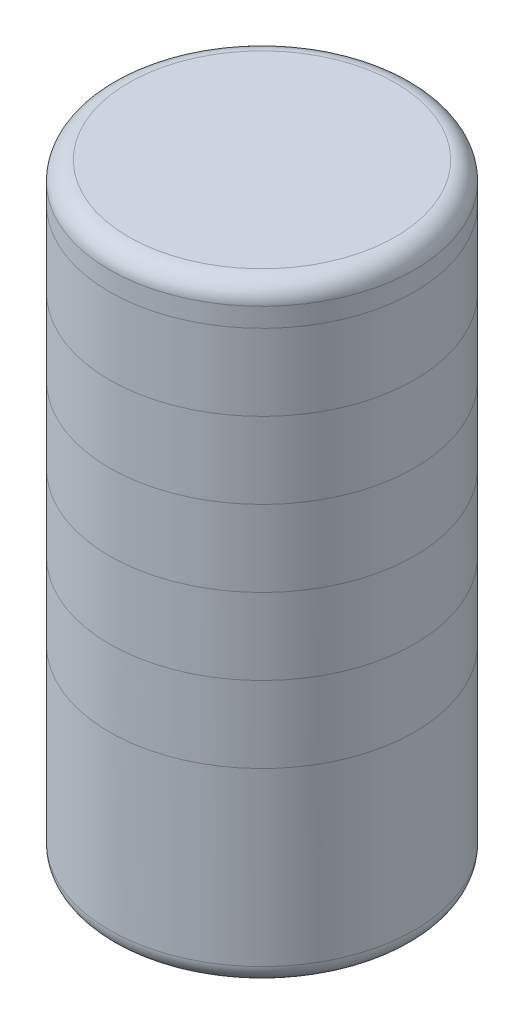
ISO-10303-21;
HEADER;
FILE_DESCRIPTION(('STEP AP214'),'2;1');
FILE_NAME('part.step','',(''),(''),'','','');
FILE_SCHEMA(('AUTOMOTIVE_DESIGN { 1 0 10303 214 1 1 1 1 }'));
ENDSEC;
DATA;
#1=APPLICATION_CONTEXT('core data for automotive mechanical design processes');
#2=APPLICATION_PROTOCOL_DEFINITION('international standard','automotive_design',2000,#1);
#3=PRODUCT_CONTEXT('',#1,'mechanical');
#4=PRODUCT('Part','Part','',(#3));
#5=PRODUCT_RELATED_PRODUCT_CATEGORY('part','',(#4));
#6=PRODUCT_DEFINITION_FORMATION('','',#4);
#7=PRODUCT_DEFINITION_CONTEXT('part definition',#1,'design');
#8=PRODUCT_DEFINITION('design','',#6,#7);
#9=PRODUCT_DEFINITION_SHAPE('','',#8);
#10=(LENGTH_UNIT() NAMED_UNIT(*) SI_UNIT(.MILLI.,.METRE.));
#11=(NAMED_UNIT(*) PLANE_ANGLE_UNIT() SI_UNIT($,.RADIAN.));
#12=(NAMED_UNIT(*) SI_UNIT($,.STERADIAN.) SOLID_ANGLE_UNIT());
#13=UNCERTAINTY_MEASURE_WITH_UNIT(LENGTH_MEASURE(1.E-05),#10,'distance_accuracy_value','');
#14=(GEOMETRIC_REPRESENTATION_CONTEXT(3) GLOBAL_UNCERTAINTY_ASSIGNED_CONTEXT((#13)) GLOBAL_UNIT_ASSIGNED_CONTEXT((#10,
#11,#12)) REPRESENTATION_CONTEXT('',''));
#15=CARTESIAN_POINT('',(0.,0.,0.));
#16=DIRECTION('',(0.,0.,1.));
#17=DIRECTION('',(1.,0.,0.));
#18=AXIS2_PLACEMENT_3D('',#15,#16,#17);
#19=CARTESIAN_POINT('',(0.,101.6,0.));
#20=DIRECTION('',(0.,-1.,0.));
#21=DIRECTION('',(0.,0.,-1.));
#22=AXIS2_PLACEMENT_3D('',#19,#20,#21);
#23=CYLINDRICAL_SURFACE('',#22,25.4);
#24=CARTESIAN_POINT('',(0.,31.75,0.));
#25=DIRECTION('',(0.,1.,0.));
#26=DIRECTION('',(-1.,0.,0.));
#27=AXIS2_PLACEMENT_3D('',#24,#25,#26);
#28=CIRCLE('',#27,25.4);
#29=CARTESIAN_POINT('',(-25.4,31.75,0.));
#30=VERTEX_POINT('',#29);
#31=EDGE_CURVE('E70',#30,#30,#28,.T.);
#32=ORIENTED_EDGE('',*,*,#31,.T.);
#33=EDGE_LOOP('',(#32));
#34=FACE_BOUND('',#33,.T.);
#35=CARTESIAN_POINT('',(0.,44.45,0.));
#36=DIRECTION('',(0.,1.,0.));
#37=DIRECTION('',(0.,0.,1.));
#38=AXIS2_PLACEMENT_3D('',#35,#36,#37);
#39=CIRCLE('',#38,25.4);
#40=CARTESIAN_POINT('',(0.,44.45,25.4));
#41=VERTEX_POINT('',#40);
#42=EDGE_CURVE('E54',#41,#41,#39,.T.);
#43=ORIENTED_EDGE('',*,*,#42,.F.);
#44=EDGE_LOOP('',(#43));
#45=FACE_BOUND('',#44,.T.);
#46=ADVANCED_FACE('F34',(#34,#45),#23,.T.);
#47=ORIENTED_EDGE('',*,*,#42,.T.);
#48=EDGE_LOOP('',(#47));
#49=FACE_BOUND('',#48,.T.);
#50=CARTESIAN_POINT('',(0.,57.15,0.));
#51=DIRECTION('',(0.,1.,0.));
#52=DIRECTION('',(0.,0.,1.));
#53=AXIS2_PLACEMENT_3D('',#50,#51,#52);
#54=CIRCLE('',#53,25.4);
#55=CARTESIAN_POINT('',(0.,57.15,25.4));
#56=VERTEX_POINT('',#55);
#57=EDGE_CURVE('E58',#56,#56,#54,.T.);
#58=ORIENTED_EDGE('',*,*,#57,.F.);
#59=EDGE_LOOP('',(#58));
#60=FACE_BOUND('',#59,.T.);
#61=ADVANCED_FACE('F97',(#49,#60),#23,.T.);
#62=ORIENTED_EDGE('',*,*,#57,.T.);
#63=EDGE_LOOP('',(#62));
#64=FACE_BOUND('',#63,.T.);
#65=CARTESIAN_POINT('',(0.,69.85,0.));
#66=DIRECTION('',(0.,1.,0.));
#67=DIRECTION('',(0.,0.,1.));
#68=AXIS2_PLACEMENT_3D('',#65,#66,#67);
#69=CIRCLE('',#68,25.4);
#70=CARTESIAN_POINT('',(0.,69.85,25.4));
#71=VERTEX_POINT('',#70);
#72=EDGE_CURVE('E62',#71,#71,#69,.T.);
#73=ORIENTED_EDGE('',*,*,#72,.F.);
#74=EDGE_LOOP('',(#73));
#75=FACE_BOUND('',#74,.T.);
#76=ADVANCED_FACE('F102',(#64,#75),#23,.T.);
#77=ORIENTED_EDGE('',*,*,#72,.T.);
#78=EDGE_LOOP('',(#77));
#79=FACE_BOUND('',#78,.T.);
#80=CARTESIAN_POINT('',(0.,82.55,0.));
#81=DIRECTION('',(0.,1.,0.));
#82=DIRECTION('',(0.,0.,1.));
#83=AXIS2_PLACEMENT_3D('',#80,#81,#82);
#84=CIRCLE('',#83,25.4);
#85=CARTESIAN_POINT('',(0.,82.55,25.4));
#86=VERTEX_POINT('',#85);
#87=EDGE_CURVE('E66',#86,#86,#84,.T.);
#88=ORIENTED_EDGE('',*,*,#87,.F.);
#89=EDGE_LOOP('',(#88));
#90=FACE_BOUND('',#89,.T.);
#91=ADVANCED_FACE('F94',(#79,#90),#23,.T.);
#92=CARTESIAN_POINT('',(0.,3.175,0.));
#93=DIRECTION('',(0.,1.,0.));
#94=DIRECTION('',(0.,0.,1.));
#95=AXIS2_PLACEMENT_3D('',#92,#93,#94);
#96=CIRCLE('',#95,25.4);
#97=CARTESIAN_POINT('',(0.,3.175,25.4));
#98=VERTEX_POINT('',#97);
#99=EDGE_CURVE('E41',#98,#98,#96,.T.);
#100=ORIENTED_EDGE('',*,*,#99,.T.);
#101=EDGE_LOOP('',(#100));
#102=FACE_BOUND('',#101,.T.);
#103=ORIENTED_EDGE('',*,*,#31,.F.);
#104=EDGE_LOOP('',(#103));
#105=FACE_BOUND('',#104,.T.);
#106=ADVANCED_FACE('F85',(#102,#105),#23,.T.);
#107=CARTESIAN_POINT('',(0.,98.425,0.));
#108=DIRECTION('',(0.,1.,0.));
#109=DIRECTION('',(0.,0.,1.));
#110=AXIS2_PLACEMENT_3D('',#107,#108,#109);
#111=CIRCLE('',#110,25.4);
#112=CARTESIAN_POINT('',(0.,98.425,25.4));
#113=VERTEX_POINT('',#112);
#114=EDGE_CURVE('E45',#113,#113,#111,.F.);
#115=ORIENTED_EDGE('',*,*,#114,.T.);
#116=EDGE_LOOP('',(#115));
#117=FACE_BOUND('',#116,.T.);
#118=CARTESIAN_POINT('',(0.,95.25,0.));
#119=DIRECTION('',(0.,-1.,0.));
#120=DIRECTION('',(0.,0.,-1.));
#121=AXIS2_PLACEMENT_3D('',#118,#119,#120);
#122=CIRCLE('',#121,25.4);
#123=CARTESIAN_POINT('',(0.,95.25,-25.4));
#124=VERTEX_POINT('',#123);
#125=EDGE_CURVE('E74',#124,#124,#122,.T.);
#126=ORIENTED_EDGE('',*,*,#125,.F.);
#127=EDGE_LOOP('',(#126));
#128=FACE_BOUND('',#127,.T.);
#129=ADVANCED_FACE('F83',(#117,#128),#23,.T.);
#130=ORIENTED_EDGE('',*,*,#87,.T.);
#131=EDGE_LOOP('',(#130));
#132=FACE_BOUND('',#131,.T.);
#133=ORIENTED_EDGE('',*,*,#125,.T.);
#134=EDGE_LOOP('',(#133));
#135=FACE_BOUND('',#134,.T.);
#136=ADVANCED_FACE('F81',(#132,#135),#23,.T.);
#137=CARTESIAN_POINT('',(0.,101.6,0.));
#138=DIRECTION('',(0.,1.,0.));
#139=DIRECTION('',(0.,0.,1.));
#140=AXIS2_PLACEMENT_3D('',#137,#138,#139);
#141=PLANE('',#140);
#142=CARTESIAN_POINT('',(0.,101.6,0.));
#143=DIRECTION('',(0.,1.,0.));
#144=DIRECTION('',(0.,0.,1.));
#145=AXIS2_PLACEMENT_3D('',#142,#143,#144);
#146=CIRCLE('',#145,22.225);
#147=CARTESIAN_POINT('',(0.,101.6,22.225));
#148=VERTEX_POINT('',#147);
#149=EDGE_CURVE('E49',#148,#148,#146,.T.);
#150=ORIENTED_EDGE('',*,*,#149,.T.);
#151=EDGE_LOOP('',(#150));
#152=FACE_BOUND('',#151,.T.);
#153=ADVANCED_FACE('F92',(#152),#141,.T.);
#154=CARTESIAN_POINT('',(0.,0.,0.));
#155=DIRECTION('',(0.,1.,0.));
#156=DIRECTION('',(0.,0.,1.));
#157=AXIS2_PLACEMENT_3D('',#154,#155,#156);
#158=PLANE('',#157);
#159=CARTESIAN_POINT('',(0.,0.,0.));
#160=DIRECTION('',(0.,1.,0.));
#161=DIRECTION('',(0.,0.,1.));
#162=AXIS2_PLACEMENT_3D('',#159,#160,#161);
#163=CIRCLE('',#162,22.225);
#164=CARTESIAN_POINT('',(0.,0.,22.225));
#165=VERTEX_POINT('',#164);
#166=EDGE_CURVE('E10',#165,#165,#163,.F.);
#167=ORIENTED_EDGE('',*,*,#166,.T.);
#168=EDGE_LOOP('',(#167));
#169=FACE_BOUND('',#168,.T.);
#170=ADVANCED_FACE('F139',(#169),#158,.F.);
#171=CARTESIAN_POINT('',(0.,98.425,0.));
#172=DIRECTION('',(0.,1.,0.));
#173=DIRECTION('',(0.,0.,1.));
#174=AXIS2_PLACEMENT_3D('',#171,#172,#173);
#175=TOROIDAL_SURFACE('',#174,22.225,3.175);
#176=ORIENTED_EDGE('',*,*,#114,.F.);
#177=EDGE_LOOP('',(#176));
#178=FACE_BOUND('',#177,.T.);
#179=ORIENTED_EDGE('',*,*,#149,.F.);
#180=EDGE_LOOP('',(#179));
#181=FACE_BOUND('',#180,.T.);
#182=ADVANCED_FACE('F134',(#178,#181),#175,.T.);
#183=CARTESIAN_POINT('',(0.,3.175,0.));
#184=DIRECTION('',(0.,1.,0.));
#185=DIRECTION('',(0.,0.,1.));
#186=AXIS2_PLACEMENT_3D('',#183,#184,#185);
#187=TOROIDAL_SURFACE('',#186,22.225,3.175);
#188=ORIENTED_EDGE('',*,*,#166,.F.);
#189=EDGE_LOOP('',(#188));
#190=FACE_BOUND('',#189,.T.);
#191=ORIENTED_EDGE('',*,*,#99,.F.);
#192=EDGE_LOOP('',(#191));
#193=FACE_BOUND('',#192,.T.);
#194=ADVANCED_FACE('F36',(#190,#193),#187,.T.);
#195=CLOSED_SHELL('',(#46,#61,#76,#91,#106,#129,#136,#153,#170,#182,#194));
#196=MANIFOLD_SOLID_BREP('B2',#195);
#197=ADVANCED_BREP_SHAPE_REPRESENTATION('',(#18,#196),#14);
#198=SHAPE_DEFINITION_REPRESENTATION(#9,#197);
ENDSEC;
END-ISO-10303-21;
